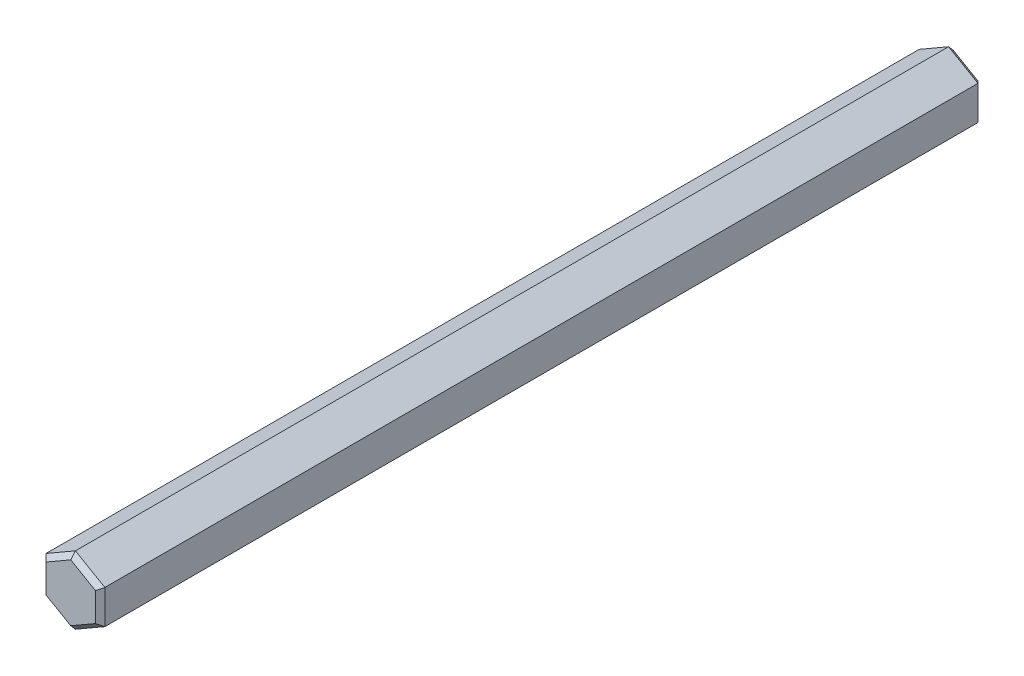
ISO-10303-21;
HEADER;
FILE_DESCRIPTION(('STEP AP214'),'2;1');
FILE_NAME('part.step','',(''),(''),'','','');
FILE_SCHEMA(('AUTOMOTIVE_DESIGN { 1 0 10303 214 1 1 1 1 }'));
ENDSEC;
DATA;
#1=APPLICATION_CONTEXT('core data for automotive mechanical design processes');
#2=APPLICATION_PROTOCOL_DEFINITION('international standard','automotive_design',2000,#1);
#3=PRODUCT_CONTEXT('',#1,'mechanical');
#4=PRODUCT('Part','Part','',(#3));
#5=PRODUCT_RELATED_PRODUCT_CATEGORY('part','',(#4));
#6=PRODUCT_DEFINITION_FORMATION('','',#4);
#7=PRODUCT_DEFINITION_CONTEXT('part definition',#1,'design');
#8=PRODUCT_DEFINITION('design','',#6,#7);
#9=PRODUCT_DEFINITION_SHAPE('','',#8);
#10=(LENGTH_UNIT() NAMED_UNIT(*) SI_UNIT(.MILLI.,.METRE.));
#11=(NAMED_UNIT(*) PLANE_ANGLE_UNIT() SI_UNIT($,.RADIAN.));
#12=(NAMED_UNIT(*) SI_UNIT($,.STERADIAN.) SOLID_ANGLE_UNIT());
#13=UNCERTAINTY_MEASURE_WITH_UNIT(LENGTH_MEASURE(1.E-05),#10,'distance_accuracy_value','');
#14=(GEOMETRIC_REPRESENTATION_CONTEXT(3) GLOBAL_UNCERTAINTY_ASSIGNED_CONTEXT((#13)) GLOBAL_UNIT_ASSIGNED_CONTEXT((#10,
#11,#12)) REPRESENTATION_CONTEXT('',''));
#15=CARTESIAN_POINT('',(0.,0.,0.));
#16=DIRECTION('',(0.,0.,1.));
#17=DIRECTION('',(1.,0.,0.));
#18=AXIS2_PLACEMENT_3D('',#15,#16,#17);
#19=CARTESIAN_POINT('',(-1.775,-1.63101451046069,74.8));
#20=DIRECTION('',(-0.353553390593274,-0.612372435695795,0.707106781186547));
#21=DIRECTION('',(0.,-0.755928946018454,-0.654653670707978));
#22=AXIS2_PLACEMENT_3D('',#19,#20,#21);
#23=PLANE('',#22);
#24=DIRECTION('',(0.866025403784439,-0.5,0.));
#25=VECTOR('',#24,1.);
#26=CARTESIAN_POINT('',(-2.1,-1.21243556529822,75.));
#27=LINE('',#26,#25);
#28=CARTESIAN_POINT('',(-2.10000000000001,-1.21243556529822,75.));
#29=VERTEX_POINT('',#28);
#30=CARTESIAN_POINT('',(0.,-2.42487113059644,75.));
#31=VERTEX_POINT('',#30);
#32=EDGE_CURVE('E120',#29,#31,#27,.T.);
#33=ORIENTED_EDGE('',*,*,#32,.F.);
#34=DIRECTION('',(0.654653670707977,0.377964473009227,0.654653670707977));
#35=VECTOR('',#34,1.);
#36=CARTESIAN_POINT('',(-2.5,-1.44337567297407,74.6));
#37=LINE('',#36,#35);
#38=CARTESIAN_POINT('',(-2.5,-1.44337567297407,74.6));
#39=VERTEX_POINT('',#38);
#40=EDGE_CURVE('E108',#39,#29,#37,.T.);
#41=ORIENTED_EDGE('',*,*,#40,.F.);
#42=DIRECTION('',(0.866025403784439,-0.5,0.));
#43=VECTOR('',#42,1.);
#44=CARTESIAN_POINT('',(-2.5,-1.44337567297406,74.6));
#45=LINE('',#44,#43);
#46=CARTESIAN_POINT('',(0.,-2.88675134594812,74.6));
#47=VERTEX_POINT('',#46);
#48=EDGE_CURVE('E131',#47,#39,#45,.F.);
#49=ORIENTED_EDGE('',*,*,#48,.F.);
#50=DIRECTION('',(0.,-0.755928946018454,-0.654653670707978));
#51=VECTOR('',#50,1.);
#52=CARTESIAN_POINT('',(0.,-2.48260615751539,74.95));
#53=LINE('',#52,#51);
#54=EDGE_CURVE('E20',#31,#47,#53,.T.);
#55=ORIENTED_EDGE('',*,*,#54,.F.);
#56=EDGE_LOOP('',(#33,#41,#49,#55));
#57=FACE_BOUND('',#56,.T.);
#58=ADVANCED_FACE('F17',(#57),#23,.T.);
#59=CARTESIAN_POINT('',(0.524999999999999,-2.35270234694773,74.8));
#60=DIRECTION('',(0.353553390593274,-0.612372435695795,0.707106781186547));
#61=DIRECTION('',(0.,-0.755928946018454,-0.654653670707978));
#62=AXIS2_PLACEMENT_3D('',#59,#60,#61);
#63=PLANE('',#62);
#64=DIRECTION('',(0.866025403784439,0.5,0.));
#65=VECTOR('',#64,1.);
#66=CARTESIAN_POINT('',(0.,-2.88675134594813,74.6));
#67=LINE('',#66,#65);
#68=CARTESIAN_POINT('',(2.5,-1.44337567297407,74.6));
#69=VERTEX_POINT('',#68);
#70=EDGE_CURVE('E147',#69,#47,#67,.F.);
#71=ORIENTED_EDGE('',*,*,#70,.F.);
#72=DIRECTION('',(0.65465367070798,-0.377964473009228,-0.654653670707974));
#73=VECTOR('',#72,1.);
#74=CARTESIAN_POINT('',(2.10000000000001,-1.21243556529822,75.));
#75=LINE('',#74,#73);
#76=CARTESIAN_POINT('',(2.1,-1.21243556529822,75.));
#77=VERTEX_POINT('',#76);
#78=EDGE_CURVE('E164',#77,#69,#75,.T.);
#79=ORIENTED_EDGE('',*,*,#78,.F.);
#80=DIRECTION('',(0.866025403784439,0.5,0.));
#81=VECTOR('',#80,1.);
#82=CARTESIAN_POINT('',(0.,-2.42487113059643,75.));
#83=LINE('',#82,#81);
#84=EDGE_CURVE('E122',#31,#77,#83,.T.);
#85=ORIENTED_EDGE('',*,*,#84,.F.);
#86=ORIENTED_EDGE('',*,*,#54,.T.);
#87=EDGE_LOOP('',(#71,#79,#85,#86));
#88=FACE_BOUND('',#87,.T.);
#89=ADVANCED_FACE('F144',(#88),#63,.T.);
#90=CARTESIAN_POINT('',(-1.775,-1.63101451046069,0.2));
#91=DIRECTION('',(-0.353553390593274,-0.612372435695795,-0.707106781186547));
#92=DIRECTION('',(0.,0.755928946018454,-0.654653670707978));
#93=AXIS2_PLACEMENT_3D('',#90,#91,#92);
#94=PLANE('',#93);
#95=DIRECTION('',(0.866025403784439,-0.5,0.));
#96=VECTOR('',#95,1.);
#97=CARTESIAN_POINT('',(-2.1,-1.21243556529821,0.));
#98=LINE('',#97,#96);
#99=CARTESIAN_POINT('',(-2.1,-1.21243556529821,0.));
#100=VERTEX_POINT('',#99);
#101=CARTESIAN_POINT('',(0.,-2.42487113059643,0.));
#102=VERTEX_POINT('',#101);
#103=EDGE_CURVE('E206',#100,#102,#98,.T.);
#104=ORIENTED_EDGE('',*,*,#103,.T.);
#105=DIRECTION('',(0.,0.755928946018454,-0.654653670707978));
#106=VECTOR('',#105,1.);
#107=CARTESIAN_POINT('',(0.,-2.48260615751539,0.0500000000000001));
#108=LINE('',#107,#106);
#109=CARTESIAN_POINT('',(0.,-2.88675134594813,0.400000000000001));
#110=VERTEX_POINT('',#109);
#111=EDGE_CURVE('E117',#110,#102,#108,.T.);
#112=ORIENTED_EDGE('',*,*,#111,.F.);
#113=DIRECTION('',(0.866025403784439,-0.5,0.));
#114=VECTOR('',#113,1.);
#115=CARTESIAN_POINT('',(-2.5,-1.44337567297406,0.400000000000001));
#116=LINE('',#115,#114);
#117=CARTESIAN_POINT('',(-2.5,-1.44337567297406,0.400000000000001));
#118=VERTEX_POINT('',#117);
#119=EDGE_CURVE('E128',#118,#110,#116,.T.);
#120=ORIENTED_EDGE('',*,*,#119,.F.);
#121=DIRECTION('',(-0.654653670707978,-0.377964473009226,0.654653670707978));
#122=VECTOR('',#121,1.);
#123=CARTESIAN_POINT('',(-2.1,-1.21243556529822,0.));
#124=LINE('',#123,#122);
#125=EDGE_CURVE('E116',#100,#118,#124,.T.);
#126=ORIENTED_EDGE('',*,*,#125,.F.);
#127=EDGE_LOOP('',(#104,#112,#120,#126));
#128=FACE_BOUND('',#127,.T.);
#129=ADVANCED_FACE('F270',(#128),#94,.T.);
#130=CARTESIAN_POINT('',(0.524999999999999,-2.35270234694773,0.2));
#131=DIRECTION('',(0.353553390593274,-0.612372435695795,-0.707106781186547));
#132=DIRECTION('',(0.,0.755928946018454,-0.654653670707978));
#133=AXIS2_PLACEMENT_3D('',#130,#131,#132);
#134=PLANE('',#133);
#135=DIRECTION('',(0.866025403784439,0.5,0.));
#136=VECTOR('',#135,1.);
#137=CARTESIAN_POINT('',(0.,-2.42487113059643,0.));
#138=LINE('',#137,#136);
#139=CARTESIAN_POINT('',(2.1,-1.21243556529821,0.));
#140=VERTEX_POINT('',#139);
#141=EDGE_CURVE('E204',#102,#140,#138,.T.);
#142=ORIENTED_EDGE('',*,*,#141,.T.);
#143=DIRECTION('',(-0.654653670707977,0.377964473009226,-0.654653670707978));
#144=VECTOR('',#143,1.);
#145=CARTESIAN_POINT('',(2.5,-1.44337567297406,0.400000000000001));
#146=LINE('',#145,#144);
#147=CARTESIAN_POINT('',(2.5,-1.44337567297406,0.4));
#148=VERTEX_POINT('',#147);
#149=EDGE_CURVE('E216',#148,#140,#146,.T.);
#150=ORIENTED_EDGE('',*,*,#149,.F.);
#151=DIRECTION('',(0.866025403784439,0.5,0.));
#152=VECTOR('',#151,1.);
#153=CARTESIAN_POINT('',(0.,-2.88675134594813,0.4));
#154=LINE('',#153,#152);
#155=EDGE_CURVE('E157',#110,#148,#154,.T.);
#156=ORIENTED_EDGE('',*,*,#155,.F.);
#157=ORIENTED_EDGE('',*,*,#111,.T.);
#158=EDGE_LOOP('',(#142,#150,#156,#157));
#159=FACE_BOUND('',#158,.T.);
#160=ADVANCED_FACE('F272',(#159),#134,.T.);
#161=CARTESIAN_POINT('',(-2.3,0.721687836487032,74.8));
#162=DIRECTION('',(-0.707106781186548,0.,0.707106781186547));
#163=DIRECTION('',(0.707106781186547,0.,0.707106781186548));
#164=AXIS2_PLACEMENT_3D('',#161,#162,#163);
#165=PLANE('',#164);
#166=DIRECTION('',(0.,1.,0.));
#167=VECTOR('',#166,1.);
#168=CARTESIAN_POINT('',(-2.10000000000001,0.,75.));
#169=LINE('',#168,#167);
#170=CARTESIAN_POINT('',(-2.10000000000001,1.21243556529822,75.));
#171=VERTEX_POINT('',#170);
#172=EDGE_CURVE('E111',#171,#29,#169,.F.);
#173=ORIENTED_EDGE('',*,*,#172,.F.);
#174=DIRECTION('',(0.654653670707979,-0.377964473009228,0.654653670707975));
#175=VECTOR('',#174,1.);
#176=CARTESIAN_POINT('',(-2.50000000000001,1.44337567297407,74.6));
#177=LINE('',#176,#175);
#178=CARTESIAN_POINT('',(-2.50000000000001,1.44337567297407,74.6));
#179=VERTEX_POINT('',#178);
#180=EDGE_CURVE('E202',#179,#171,#177,.T.);
#181=ORIENTED_EDGE('',*,*,#180,.F.);
#182=DIRECTION('',(0.,1.,0.));
#183=VECTOR('',#182,1.);
#184=CARTESIAN_POINT('',(-2.5,1.44337567297406,74.6));
#185=LINE('',#184,#183);
#186=EDGE_CURVE('E114',#39,#179,#185,.T.);
#187=ORIENTED_EDGE('',*,*,#186,.F.);
#188=ORIENTED_EDGE('',*,*,#40,.T.);
#189=EDGE_LOOP('',(#173,#181,#187,#188));
#190=FACE_BOUND('',#189,.T.);
#191=ADVANCED_FACE('F109',(#190),#165,.T.);
#192=CARTESIAN_POINT('',(-2.3,0.721687836487032,0.2));
#193=DIRECTION('',(-0.707106781186548,0.,-0.707106781186548));
#194=DIRECTION('',(-0.707106781186548,0.,0.707106781186548));
#195=AXIS2_PLACEMENT_3D('',#192,#193,#194);
#196=PLANE('',#195);
#197=DIRECTION('',(0.,1.,0.));
#198=VECTOR('',#197,1.);
#199=CARTESIAN_POINT('',(-2.5,1.44337567297406,0.4));
#200=LINE('',#199,#198);
#201=CARTESIAN_POINT('',(-2.5,1.44337567297406,0.4));
#202=VERTEX_POINT('',#201);
#203=EDGE_CURVE('E192',#202,#118,#200,.F.);
#204=ORIENTED_EDGE('',*,*,#203,.F.);
#205=DIRECTION('',(-0.654653670707977,0.377964473009226,0.654653670707978));
#206=VECTOR('',#205,1.);
#207=CARTESIAN_POINT('',(-2.1,1.21243556529821,0.));
#208=LINE('',#207,#206);
#209=CARTESIAN_POINT('',(-2.1,1.21243556529821,0.));
#210=VERTEX_POINT('',#209);
#211=EDGE_CURVE('E196',#210,#202,#208,.T.);
#212=ORIENTED_EDGE('',*,*,#211,.F.);
#213=DIRECTION('',(0.,1.,0.));
#214=VECTOR('',#213,1.);
#215=CARTESIAN_POINT('',(-2.1,0.,0.));
#216=LINE('',#215,#214);
#217=EDGE_CURVE('E208',#210,#100,#216,.F.);
#218=ORIENTED_EDGE('',*,*,#217,.T.);
#219=ORIENTED_EDGE('',*,*,#125,.T.);
#220=EDGE_LOOP('',(#204,#212,#218,#219));
#221=FACE_BOUND('',#220,.T.);
#222=ADVANCED_FACE('F263',(#221),#196,.T.);
#223=CARTESIAN_POINT('',(-2.5,-1.44337567297406,0.));
#224=DIRECTION('',(-0.5,-0.866025403784439,0.));
#225=DIRECTION('',(0.866025403784439,-0.5,0.));
#226=AXIS2_PLACEMENT_3D('',#223,#224,#225);
#227=PLANE('',#226);
#228=ORIENTED_EDGE('',*,*,#119,.T.);
#229=DIRECTION('',(0.,0.,1.));
#230=VECTOR('',#229,1.);
#231=CARTESIAN_POINT('',(0.,-2.88675134594813,0.));
#232=LINE('',#231,#230);
#233=EDGE_CURVE('E151',#47,#110,#232,.F.);
#234=ORIENTED_EDGE('',*,*,#233,.F.);
#235=ORIENTED_EDGE('',*,*,#48,.T.);
#236=DIRECTION('',(0.,0.,1.));
#237=VECTOR('',#236,1.);
#238=CARTESIAN_POINT('',(-2.5,-1.44337567297406,0.));
#239=LINE('',#238,#237);
#240=EDGE_CURVE('E187',#118,#39,#239,.T.);
#241=ORIENTED_EDGE('',*,*,#240,.F.);
#242=EDGE_LOOP('',(#228,#234,#235,#241));
#243=FACE_BOUND('',#242,.T.);
#244=ADVANCED_FACE('F152',(#243),#227,.T.);
#245=CARTESIAN_POINT('',(0.,0.,75.));
#246=DIRECTION('',(0.,0.,1.));
#247=DIRECTION('',(1.,0.,0.));
#248=AXIS2_PLACEMENT_3D('',#245,#246,#247);
#249=PLANE('',#248);
#250=DIRECTION('',(0.,1.,0.));
#251=VECTOR('',#250,1.);
#252=CARTESIAN_POINT('',(2.10000000000001,-0.721687836487033,75.));
#253=LINE('',#252,#251);
#254=CARTESIAN_POINT('',(2.1,1.21243556529822,75.));
#255=VERTEX_POINT('',#254);
#256=EDGE_CURVE('E166',#255,#77,#253,.F.);
#257=ORIENTED_EDGE('',*,*,#256,.F.);
#258=DIRECTION('',(0.866025403784439,-0.5,0.));
#259=VECTOR('',#258,1.);
#260=CARTESIAN_POINT('',(0.,2.42487113059644,75.));
#261=LINE('',#260,#259);
#262=CARTESIAN_POINT('',(0.,2.42487113059644,75.));
#263=VERTEX_POINT('',#262);
#264=EDGE_CURVE('E181',#263,#255,#261,.T.);
#265=ORIENTED_EDGE('',*,*,#264,.F.);
#266=DIRECTION('',(0.866025403784439,0.5,0.));
#267=VECTOR('',#266,1.);
#268=CARTESIAN_POINT('',(-2.10000000000001,1.21243556529822,75.));
#269=LINE('',#268,#267);
#270=EDGE_CURVE('E126',#171,#263,#269,.T.);
#271=ORIENTED_EDGE('',*,*,#270,.F.);
#272=ORIENTED_EDGE('',*,*,#172,.T.);
#273=ORIENTED_EDGE('',*,*,#32,.T.);
#274=ORIENTED_EDGE('',*,*,#84,.T.);
#275=EDGE_LOOP('',(#257,#265,#271,#272,#273,#274));
#276=FACE_BOUND('',#275,.T.);
#277=ADVANCED_FACE('F124',(#276),#249,.T.);
#278=CARTESIAN_POINT('',(2.3,-0.721687836487033,74.8));
#279=DIRECTION('',(0.707106781186548,0.,0.707106781186547));
#280=DIRECTION('',(0.707106781186547,0.,-0.707106781186548));
#281=AXIS2_PLACEMENT_3D('',#278,#279,#280);
#282=PLANE('',#281);
#283=DIRECTION('',(0.,1.,0.));
#284=VECTOR('',#283,1.);
#285=CARTESIAN_POINT('',(2.5,-1.44337567297406,74.6));
#286=LINE('',#285,#284);
#287=CARTESIAN_POINT('',(2.50000000000001,1.44337567297406,74.6));
#288=VERTEX_POINT('',#287);
#289=EDGE_CURVE('E177',#288,#69,#286,.F.);
#290=ORIENTED_EDGE('',*,*,#289,.F.);
#291=DIRECTION('',(0.65465367070798,0.377964473009225,-0.654653670707976));
#292=VECTOR('',#291,1.);
#293=CARTESIAN_POINT('',(2.10000000000001,1.21243556529822,75.));
#294=LINE('',#293,#292);
#295=EDGE_CURVE('E175',#255,#288,#294,.T.);
#296=ORIENTED_EDGE('',*,*,#295,.F.);
#297=ORIENTED_EDGE('',*,*,#256,.T.);
#298=ORIENTED_EDGE('',*,*,#78,.T.);
#299=EDGE_LOOP('',(#290,#296,#297,#298));
#300=FACE_BOUND('',#299,.T.);
#301=ADVANCED_FACE('F173',(#300),#282,.T.);
#302=CARTESIAN_POINT('',(0.,-2.88675134594813,0.));
#303=DIRECTION('',(0.5,-0.866025403784439,0.));
#304=DIRECTION('',(0.866025403784439,0.5,0.));
#305=AXIS2_PLACEMENT_3D('',#302,#303,#304);
#306=PLANE('',#305);
#307=ORIENTED_EDGE('',*,*,#155,.T.);
#308=DIRECTION('',(0.,0.,-1.));
#309=VECTOR('',#308,1.);
#310=CARTESIAN_POINT('',(2.5,-1.44337567297407,0.));
#311=LINE('',#310,#309);
#312=EDGE_CURVE('E162',#69,#148,#311,.T.);
#313=ORIENTED_EDGE('',*,*,#312,.F.);
#314=ORIENTED_EDGE('',*,*,#70,.T.);
#315=ORIENTED_EDGE('',*,*,#233,.T.);
#316=EDGE_LOOP('',(#307,#313,#314,#315));
#317=FACE_BOUND('',#316,.T.);
#318=ADVANCED_FACE('F160',(#317),#306,.T.);
#319=CARTESIAN_POINT('',(2.3,-0.721687836487033,0.2));
#320=DIRECTION('',(0.707106781186548,0.,-0.707106781186548));
#321=DIRECTION('',(-0.707106781186548,0.,-0.707106781186548));
#322=AXIS2_PLACEMENT_3D('',#319,#320,#321);
#323=PLANE('',#322);
#324=DIRECTION('',(0.,1.,0.));
#325=VECTOR('',#324,1.);
#326=CARTESIAN_POINT('',(2.1,0.,0.));
#327=LINE('',#326,#325);
#328=CARTESIAN_POINT('',(2.1,1.21243556529821,0.));
#329=VERTEX_POINT('',#328);
#330=EDGE_CURVE('E211',#140,#329,#327,.T.);
#331=ORIENTED_EDGE('',*,*,#330,.T.);
#332=DIRECTION('',(0.654653670707977,0.377964473009227,0.654653670707977));
#333=VECTOR('',#332,1.);
#334=CARTESIAN_POINT('',(2.1,1.21243556529821,0.));
#335=LINE('',#334,#333);
#336=CARTESIAN_POINT('',(2.5,1.44337567297406,0.4));
#337=VERTEX_POINT('',#336);
#338=EDGE_CURVE('E214',#329,#337,#335,.T.);
#339=ORIENTED_EDGE('',*,*,#338,.T.);
#340=DIRECTION('',(0.,1.,0.));
#341=VECTOR('',#340,1.);
#342=CARTESIAN_POINT('',(2.5,-1.44337567297406,0.4));
#343=LINE('',#342,#341);
#344=EDGE_CURVE('E220',#148,#337,#343,.T.);
#345=ORIENTED_EDGE('',*,*,#344,.F.);
#346=ORIENTED_EDGE('',*,*,#149,.T.);
#347=EDGE_LOOP('',(#331,#339,#345,#346));
#348=FACE_BOUND('',#347,.T.);
#349=ADVANCED_FACE('F221',(#348),#323,.T.);
#350=CARTESIAN_POINT('',(0.,0.,0.));
#351=DIRECTION('',(0.,0.,1.));
#352=DIRECTION('',(1.,0.,0.));
#353=AXIS2_PLACEMENT_3D('',#350,#351,#352);
#354=PLANE('',#353);
#355=ORIENTED_EDGE('',*,*,#103,.F.);
#356=ORIENTED_EDGE('',*,*,#217,.F.);
#357=DIRECTION('',(-0.866025403784439,-0.5,0.));
#358=VECTOR('',#357,1.);
#359=CARTESIAN_POINT('',(0.,2.42487113059643,0.));
#360=LINE('',#359,#358);
#361=CARTESIAN_POINT('',(0.,2.42487113059643,0.));
#362=VERTEX_POINT('',#361);
#363=EDGE_CURVE('E198',#362,#210,#360,.T.);
#364=ORIENTED_EDGE('',*,*,#363,.F.);
#365=DIRECTION('',(-0.866025403784438,0.5,0.));
#366=VECTOR('',#365,1.);
#367=CARTESIAN_POINT('',(2.1,1.21243556529821,0.));
#368=LINE('',#367,#366);
#369=EDGE_CURVE('E224',#329,#362,#368,.T.);
#370=ORIENTED_EDGE('',*,*,#369,.F.);
#371=ORIENTED_EDGE('',*,*,#330,.F.);
#372=ORIENTED_EDGE('',*,*,#141,.F.);
#373=EDGE_LOOP('',(#355,#356,#364,#370,#371,#372));
#374=FACE_BOUND('',#373,.T.);
#375=ADVANCED_FACE('F267',(#374),#354,.F.);
#376=CARTESIAN_POINT('',(-0.525000000000001,2.35270234694773,74.8));
#377=DIRECTION('',(-0.353553390593274,0.612372435695795,0.707106781186547));
#378=DIRECTION('',(0.,-0.755928946018454,0.654653670707978));
#379=AXIS2_PLACEMENT_3D('',#376,#377,#378);
#380=PLANE('',#379);
#381=ORIENTED_EDGE('',*,*,#270,.T.);
#382=DIRECTION('',(0.,-0.755928946018454,0.654653670707978));
#383=VECTOR('',#382,1.);
#384=CARTESIAN_POINT('',(0.,2.07021310809423,75.3071428571429));
#385=LINE('',#384,#383);
#386=CARTESIAN_POINT('',(0.,2.88675134594812,74.6));
#387=VERTEX_POINT('',#386);
#388=EDGE_CURVE('E185',#387,#263,#385,.T.);
#389=ORIENTED_EDGE('',*,*,#388,.F.);
#390=DIRECTION('',(-0.866025403784439,-0.5,0.));
#391=VECTOR('',#390,1.);
#392=CARTESIAN_POINT('',(0.,2.88675134594813,74.6));
#393=LINE('',#392,#391);
#394=EDGE_CURVE('E233',#179,#387,#393,.F.);
#395=ORIENTED_EDGE('',*,*,#394,.F.);
#396=ORIENTED_EDGE('',*,*,#180,.T.);
#397=EDGE_LOOP('',(#381,#389,#395,#396));
#398=FACE_BOUND('',#397,.T.);
#399=ADVANCED_FACE('F258',(#398),#380,.T.);
#400=CARTESIAN_POINT('',(-0.525000000000001,2.35270234694773,0.2));
#401=DIRECTION('',(-0.353553390593274,0.612372435695795,-0.707106781186547));
#402=DIRECTION('',(0.,0.755928946018454,0.654653670707978));
#403=AXIS2_PLACEMENT_3D('',#400,#401,#402);
#404=PLANE('',#403);
#405=DIRECTION('',(-0.866025403784439,-0.5,0.));
#406=VECTOR('',#405,1.);
#407=CARTESIAN_POINT('',(0.,2.88675134594813,0.4));
#408=LINE('',#407,#406);
#409=CARTESIAN_POINT('',(0.,2.88675134594813,0.4));
#410=VERTEX_POINT('',#409);
#411=EDGE_CURVE('E35',#410,#202,#408,.T.);
#412=ORIENTED_EDGE('',*,*,#411,.F.);
#413=DIRECTION('',(0.,0.755928946018454,0.654653670707977));
#414=VECTOR('',#413,1.);
#415=CARTESIAN_POINT('',(0.,2.07021310809423,-0.307142857142858));
#416=LINE('',#415,#414);
#417=EDGE_CURVE('E231',#362,#410,#416,.T.);
#418=ORIENTED_EDGE('',*,*,#417,.F.);
#419=ORIENTED_EDGE('',*,*,#363,.T.);
#420=ORIENTED_EDGE('',*,*,#211,.T.);
#421=EDGE_LOOP('',(#412,#418,#419,#420));
#422=FACE_BOUND('',#421,.T.);
#423=ADVANCED_FACE('F264',(#422),#404,.T.);
#424=CARTESIAN_POINT('',(-2.5,1.44337567297406,0.));
#425=DIRECTION('',(-1.,0.,0.));
#426=DIRECTION('',(0.,0.,1.));
#427=AXIS2_PLACEMENT_3D('',#424,#425,#426);
#428=PLANE('',#427);
#429=ORIENTED_EDGE('',*,*,#203,.T.);
#430=ORIENTED_EDGE('',*,*,#240,.T.);
#431=ORIENTED_EDGE('',*,*,#186,.T.);
#432=DIRECTION('',(0.,0.,1.));
#433=VECTOR('',#432,1.);
#434=CARTESIAN_POINT('',(-2.5,1.44337567297406,0.));
#435=LINE('',#434,#433);
#436=EDGE_CURVE('E237',#202,#179,#435,.T.);
#437=ORIENTED_EDGE('',*,*,#436,.F.);
#438=EDGE_LOOP('',(#429,#430,#431,#437));
#439=FACE_BOUND('',#438,.T.);
#440=ADVANCED_FACE('F260',(#439),#428,.T.);
#441=CARTESIAN_POINT('',(1.775,1.63101451046069,74.8));
#442=DIRECTION('',(0.353553390593274,0.612372435695795,0.707106781186547));
#443=DIRECTION('',(0.,-0.755928946018454,0.654653670707978));
#444=AXIS2_PLACEMENT_3D('',#441,#442,#443);
#445=PLANE('',#444);
#446=ORIENTED_EDGE('',*,*,#264,.T.);
#447=ORIENTED_EDGE('',*,*,#295,.T.);
#448=DIRECTION('',(-0.866025403784439,0.5,0.));
#449=VECTOR('',#448,1.);
#450=CARTESIAN_POINT('',(2.5,1.44337567297406,74.6));
#451=LINE('',#450,#449);
#452=EDGE_CURVE('E240',#387,#288,#451,.F.);
#453=ORIENTED_EDGE('',*,*,#452,.F.);
#454=ORIENTED_EDGE('',*,*,#388,.T.);
#455=EDGE_LOOP('',(#446,#447,#453,#454));
#456=FACE_BOUND('',#455,.T.);
#457=ADVANCED_FACE('F184',(#456),#445,.T.);
#458=CARTESIAN_POINT('',(2.5,-1.44337567297406,0.));
#459=DIRECTION('',(1.,0.,0.));
#460=DIRECTION('',(0.,0.,-1.));
#461=AXIS2_PLACEMENT_3D('',#458,#459,#460);
#462=PLANE('',#461);
#463=ORIENTED_EDGE('',*,*,#344,.T.);
#464=DIRECTION('',(0.,0.,1.));
#465=VECTOR('',#464,1.);
#466=CARTESIAN_POINT('',(2.5,1.44337567297406,0.));
#467=LINE('',#466,#465);
#468=EDGE_CURVE('E243',#288,#337,#467,.F.);
#469=ORIENTED_EDGE('',*,*,#468,.F.);
#470=ORIENTED_EDGE('',*,*,#289,.T.);
#471=ORIENTED_EDGE('',*,*,#312,.T.);
#472=EDGE_LOOP('',(#463,#469,#470,#471));
#473=FACE_BOUND('',#472,.T.);
#474=ADVANCED_FACE('F226',(#473),#462,.T.);
#475=CARTESIAN_POINT('',(1.775,1.63101451046069,0.2));
#476=DIRECTION('',(0.353553390593274,0.612372435695794,-0.707106781186547));
#477=DIRECTION('',(0.,0.755928946018454,0.654653670707977));
#478=AXIS2_PLACEMENT_3D('',#475,#476,#477);
#479=PLANE('',#478);
#480=ORIENTED_EDGE('',*,*,#369,.T.);
#481=ORIENTED_EDGE('',*,*,#417,.T.);
#482=DIRECTION('',(-0.866025403784439,0.5,0.));
#483=VECTOR('',#482,1.);
#484=CARTESIAN_POINT('',(2.5,1.44337567297406,0.4));
#485=LINE('',#484,#483);
#486=EDGE_CURVE('E26',#337,#410,#485,.T.);
#487=ORIENTED_EDGE('',*,*,#486,.F.);
#488=ORIENTED_EDGE('',*,*,#338,.F.);
#489=EDGE_LOOP('',(#480,#481,#487,#488));
#490=FACE_BOUND('',#489,.T.);
#491=ADVANCED_FACE('F251',(#490),#479,.T.);
#492=CARTESIAN_POINT('',(0.,2.88675134594813,0.));
#493=DIRECTION('',(-0.5,0.866025403784439,0.));
#494=DIRECTION('',(-0.866025403784439,-0.5,0.));
#495=AXIS2_PLACEMENT_3D('',#492,#493,#494);
#496=PLANE('',#495);
#497=ORIENTED_EDGE('',*,*,#411,.T.);
#498=ORIENTED_EDGE('',*,*,#436,.T.);
#499=ORIENTED_EDGE('',*,*,#394,.T.);
#500=DIRECTION('',(0.,0.,1.));
#501=VECTOR('',#500,1.);
#502=CARTESIAN_POINT('',(0.,2.88675134594813,0.));
#503=LINE('',#502,#501);
#504=EDGE_CURVE('E10',#410,#387,#503,.T.);
#505=ORIENTED_EDGE('',*,*,#504,.F.);
#506=EDGE_LOOP('',(#497,#498,#499,#505));
#507=FACE_BOUND('',#506,.T.);
#508=ADVANCED_FACE('F254',(#507),#496,.T.);
#509=CARTESIAN_POINT('',(2.5,1.44337567297406,0.));
#510=DIRECTION('',(0.5,0.866025403784439,0.));
#511=DIRECTION('',(-0.866025403784439,0.5,0.));
#512=AXIS2_PLACEMENT_3D('',#509,#510,#511);
#513=PLANE('',#512);
#514=ORIENTED_EDGE('',*,*,#486,.T.);
#515=ORIENTED_EDGE('',*,*,#504,.T.);
#516=ORIENTED_EDGE('',*,*,#452,.T.);
#517=ORIENTED_EDGE('',*,*,#468,.T.);
#518=EDGE_LOOP('',(#514,#515,#516,#517));
#519=FACE_BOUND('',#518,.T.);
#520=ADVANCED_FACE('F248',(#519),#513,.T.);
#521=CLOSED_SHELL('',(#58,#89,#129,#160,#191,#222,#244,#277,#301,#318,#349,#375,#399,#423,#440,
#457,#474,#491,#508,#520));
#522=MANIFOLD_SOLID_BREP('B1',#521);
#523=ADVANCED_BREP_SHAPE_REPRESENTATION('',(#18,#522),#14);
#524=SHAPE_DEFINITION_REPRESENTATION(#9,#523);
ENDSEC;
END-ISO-10303-21;
